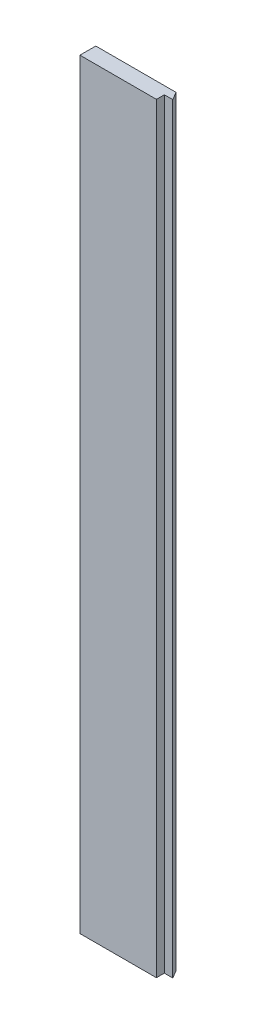
ISO-10303-21;
HEADER;
FILE_DESCRIPTION(('STEP AP214'),'2;1');
FILE_NAME('part.step','',(''),(''),'','','');
FILE_SCHEMA(('AUTOMOTIVE_DESIGN { 1 0 10303 214 1 1 1 1 }'));
ENDSEC;
DATA;
#1=APPLICATION_CONTEXT('core data for automotive mechanical design processes');
#2=APPLICATION_PROTOCOL_DEFINITION('international standard','automotive_design',2000,#1);
#3=PRODUCT_CONTEXT('',#1,'mechanical');
#4=PRODUCT('Part','Part','',(#3));
#5=PRODUCT_RELATED_PRODUCT_CATEGORY('part','',(#4));
#6=PRODUCT_DEFINITION_FORMATION('','',#4);
#7=PRODUCT_DEFINITION_CONTEXT('part definition',#1,'design');
#8=PRODUCT_DEFINITION('design','',#6,#7);
#9=PRODUCT_DEFINITION_SHAPE('','',#8);
#10=(LENGTH_UNIT() NAMED_UNIT(*) SI_UNIT(.MILLI.,.METRE.));
#11=(NAMED_UNIT(*) PLANE_ANGLE_UNIT() SI_UNIT($,.RADIAN.));
#12=(NAMED_UNIT(*) SI_UNIT($,.STERADIAN.) SOLID_ANGLE_UNIT());
#13=UNCERTAINTY_MEASURE_WITH_UNIT(LENGTH_MEASURE(1.E-05),#10,'distance_accuracy_value','');
#14=(GEOMETRIC_REPRESENTATION_CONTEXT(3) GLOBAL_UNCERTAINTY_ASSIGNED_CONTEXT((#13)) GLOBAL_UNIT_ASSIGNED_CONTEXT((#10,
#11,#12)) REPRESENTATION_CONTEXT('',''));
#15=CARTESIAN_POINT('',(0.,0.,0.));
#16=DIRECTION('',(0.,0.,1.));
#17=DIRECTION('',(1.,0.,0.));
#18=AXIS2_PLACEMENT_3D('',#15,#16,#17);
#19=CARTESIAN_POINT('',(50.5,1000.,0.));
#20=DIRECTION('',(1.,0.,0.));
#21=DIRECTION('',(0.,0.,-1.));
#22=AXIS2_PLACEMENT_3D('',#19,#20,#21);
#23=PLANE('',#22);
#24=DIRECTION('',(0.,-1.,0.));
#25=VECTOR('',#24,1.);
#26=CARTESIAN_POINT('',(50.5,1000.,0.));
#27=LINE('',#26,#25);
#28=CARTESIAN_POINT('',(50.5,863.148307071275,0.));
#29=VERTEX_POINT('',#28);
#30=CARTESIAN_POINT('',(50.5,0.,0.));
#31=VERTEX_POINT('',#30);
#32=EDGE_CURVE('E11',#29,#31,#27,.T.);
#33=ORIENTED_EDGE('',*,*,#32,.F.);
#34=DIRECTION('',(0.,0.,-1.));
#35=VECTOR('',#34,1.);
#36=CARTESIAN_POINT('',(50.5,863.148307071275,9.001));
#37=LINE('',#36,#35);
#38=CARTESIAN_POINT('',(50.5,863.148307071275,9.));
#39=VERTEX_POINT('',#38);
#40=EDGE_CURVE('E113',#39,#29,#37,.T.);
#41=ORIENTED_EDGE('',*,*,#40,.F.);
#42=DIRECTION('',(0.,-1.,0.));
#43=VECTOR('',#42,1.);
#44=CARTESIAN_POINT('',(50.5,1000.,9.));
#45=LINE('',#44,#43);
#46=CARTESIAN_POINT('',(50.5,0.,9.));
#47=VERTEX_POINT('',#46);
#48=EDGE_CURVE('E49',#39,#47,#45,.T.);
#49=ORIENTED_EDGE('',*,*,#48,.T.);
#50=DIRECTION('',(0.,0.,1.));
#51=VECTOR('',#50,1.);
#52=CARTESIAN_POINT('',(50.5,0.,0.));
#53=LINE('',#52,#51);
#54=EDGE_CURVE('E115',#31,#47,#53,.T.);
#55=ORIENTED_EDGE('',*,*,#54,.F.);
#56=EDGE_LOOP('',(#33,#41,#49,#55));
#57=FACE_BOUND('',#56,.T.);
#58=ADVANCED_FACE('F35',(#57),#23,.T.);
#59=CARTESIAN_POINT('',(0.,1000.,0.));
#60=DIRECTION('',(0.,0.,1.));
#61=DIRECTION('',(1.,0.,0.));
#62=AXIS2_PLACEMENT_3D('',#59,#60,#61);
#63=PLANE('',#62);
#64=DIRECTION('',(0.,-1.,0.));
#65=VECTOR('',#64,1.);
#66=CARTESIAN_POINT('',(60.,1000.,0.));
#67=LINE('',#66,#65);
#68=CARTESIAN_POINT('',(60.,863.148307071275,0.));
#69=VERTEX_POINT('',#68);
#70=CARTESIAN_POINT('',(60.,0.,0.));
#71=VERTEX_POINT('',#70);
#72=EDGE_CURVE('E42',#69,#71,#67,.T.);
#73=ORIENTED_EDGE('',*,*,#72,.F.);
#74=DIRECTION('',(1.,0.,0.));
#75=VECTOR('',#74,1.);
#76=CARTESIAN_POINT('',(0.,863.148307071275,0.));
#77=LINE('',#76,#75);
#78=EDGE_CURVE('E140',#29,#69,#77,.T.);
#79=ORIENTED_EDGE('',*,*,#78,.F.);
#80=ORIENTED_EDGE('',*,*,#32,.T.);
#81=DIRECTION('',(-1.,0.,0.));
#82=VECTOR('',#81,1.);
#83=CARTESIAN_POINT('',(0.,0.,0.));
#84=LINE('',#83,#82);
#85=EDGE_CURVE('E118',#71,#31,#84,.T.);
#86=ORIENTED_EDGE('',*,*,#85,.F.);
#87=EDGE_LOOP('',(#73,#79,#80,#86));
#88=FACE_BOUND('',#87,.T.);
#89=ADVANCED_FACE('F138',(#88),#63,.T.);
#90=CARTESIAN_POINT('',(45.0000000000002,1000.,-25.980762113533));
#91=DIRECTION('',(-0.866025403784441,0.,0.499999999999996));
#92=DIRECTION('',(0.499999999999997,0.,0.866025403784441));
#93=AXIS2_PLACEMENT_3D('',#90,#91,#92);
#94=PLANE('',#93);
#95=DIRECTION('',(0.499999999999997,0.,0.866025403784441));
#96=VECTOR('',#95,1.);
#97=CARTESIAN_POINT('',(48.8975473297321,863.148307071275,-19.230012113533));
#98=LINE('',#97,#96);
#99=CARTESIAN_POINT('',(54.8038475772934,863.148307071275,-9.));
#100=VERTEX_POINT('',#99);
#101=EDGE_CURVE('E99',#100,#69,#98,.T.);
#102=ORIENTED_EDGE('',*,*,#101,.T.);
#103=ORIENTED_EDGE('',*,*,#72,.T.);
#104=DIRECTION('',(-0.499999999999997,0.,-0.866025403784441));
#105=VECTOR('',#104,1.);
#106=CARTESIAN_POINT('',(45.0000000000002,0.,-25.980762113533));
#107=LINE('',#106,#105);
#108=CARTESIAN_POINT('',(54.8038475772934,0.,-9.));
#109=VERTEX_POINT('',#108);
#110=EDGE_CURVE('E121',#71,#109,#107,.T.);
#111=ORIENTED_EDGE('',*,*,#110,.T.);
#112=DIRECTION('',(0.,-1.,0.));
#113=VECTOR('',#112,1.);
#114=CARTESIAN_POINT('',(54.8038475772934,1000.,-9.));
#115=LINE('',#114,#113);
#116=EDGE_CURVE('E128',#100,#109,#115,.T.);
#117=ORIENTED_EDGE('',*,*,#116,.F.);
#118=EDGE_LOOP('',(#102,#103,#111,#117));
#119=FACE_BOUND('',#118,.T.);
#120=ADVANCED_FACE('F132',(#119),#94,.F.);
#121=CARTESIAN_POINT('',(0.,1000.,-9.));
#122=DIRECTION('',(0.,0.,-1.));
#123=DIRECTION('',(-1.,0.,0.));
#124=AXIS2_PLACEMENT_3D('',#121,#122,#123);
#125=PLANE('',#124);
#126=DIRECTION('',(0.,1.,0.));
#127=VECTOR('',#126,1.);
#128=CARTESIAN_POINT('',(-36.3038475772933,0.,-9.));
#129=LINE('',#128,#127);
#130=CARTESIAN_POINT('',(-36.3038475772933,0.,-9.));
#131=VERTEX_POINT('',#130);
#132=CARTESIAN_POINT('',(-36.3038475772933,863.148307071275,-9.));
#133=VERTEX_POINT('',#132);
#134=EDGE_CURVE('E57',#131,#133,#129,.T.);
#135=ORIENTED_EDGE('',*,*,#134,.T.);
#136=DIRECTION('',(1.,0.,0.));
#137=VECTOR('',#136,1.);
#138=CARTESIAN_POINT('',(0.,863.148307071275,-9.));
#139=LINE('',#138,#137);
#140=EDGE_CURVE('E96',#133,#100,#139,.T.);
#141=ORIENTED_EDGE('',*,*,#140,.T.);
#142=ORIENTED_EDGE('',*,*,#116,.T.);
#143=DIRECTION('',(1.,0.,0.));
#144=VECTOR('',#143,1.);
#145=CARTESIAN_POINT('',(0.,0.,-9.));
#146=LINE('',#145,#144);
#147=EDGE_CURVE('E106',#131,#109,#146,.T.);
#148=ORIENTED_EDGE('',*,*,#147,.F.);
#149=EDGE_LOOP('',(#135,#141,#142,#148));
#150=FACE_BOUND('',#149,.T.);
#151=ADVANCED_FACE('F104',(#150),#125,.T.);
#152=CARTESIAN_POINT('',(0.,1000.,9.));
#153=DIRECTION('',(0.,0.,-1.));
#154=DIRECTION('',(-1.,0.,0.));
#155=AXIS2_PLACEMENT_3D('',#152,#153,#154);
#156=PLANE('',#155);
#157=DIRECTION('',(0.,-1.,0.));
#158=VECTOR('',#157,1.);
#159=CARTESIAN_POINT('',(-36.3038475772933,0.,9.));
#160=LINE('',#159,#158);
#161=CARTESIAN_POINT('',(-36.3038475772933,863.148307071275,9.));
#162=VERTEX_POINT('',#161);
#163=CARTESIAN_POINT('',(-36.3038475772933,0.,9.));
#164=VERTEX_POINT('',#163);
#165=EDGE_CURVE('E90',#162,#164,#160,.T.);
#166=ORIENTED_EDGE('',*,*,#165,.T.);
#167=DIRECTION('',(1.,0.,0.));
#168=VECTOR('',#167,1.);
#169=CARTESIAN_POINT('',(0.,0.,9.));
#170=LINE('',#169,#168);
#171=EDGE_CURVE('E125',#164,#47,#170,.T.);
#172=ORIENTED_EDGE('',*,*,#171,.T.);
#173=ORIENTED_EDGE('',*,*,#48,.F.);
#174=DIRECTION('',(-1.,0.,0.));
#175=VECTOR('',#174,1.);
#176=CARTESIAN_POINT('',(0.,863.148307071275,9.));
#177=LINE('',#176,#175);
#178=EDGE_CURVE('E110',#39,#162,#177,.T.);
#179=ORIENTED_EDGE('',*,*,#178,.T.);
#180=EDGE_LOOP('',(#166,#172,#173,#179));
#181=FACE_BOUND('',#180,.T.);
#182=ADVANCED_FACE('F143',(#181),#156,.F.);
#183=CARTESIAN_POINT('',(0.,0.,0.));
#184=DIRECTION('',(0.,1.,0.));
#185=DIRECTION('',(0.,0.,1.));
#186=AXIS2_PLACEMENT_3D('',#183,#184,#185);
#187=PLANE('',#186);
#188=DIRECTION('',(0.,0.,-1.));
#189=VECTOR('',#188,1.);
#190=CARTESIAN_POINT('',(-36.3038475772933,0.,9.001));
#191=LINE('',#190,#189);
#192=EDGE_CURVE('E93',#164,#131,#191,.T.);
#193=ORIENTED_EDGE('',*,*,#192,.T.);
#194=ORIENTED_EDGE('',*,*,#147,.T.);
#195=ORIENTED_EDGE('',*,*,#110,.F.);
#196=ORIENTED_EDGE('',*,*,#85,.T.);
#197=ORIENTED_EDGE('',*,*,#54,.T.);
#198=ORIENTED_EDGE('',*,*,#171,.F.);
#199=EDGE_LOOP('',(#193,#194,#195,#196,#197,#198));
#200=FACE_BOUND('',#199,.T.);
#201=ADVANCED_FACE('F137',(#200),#187,.F.);
#202=CARTESIAN_POINT('',(-36.3038475772933,0.,9.001));
#203=DIRECTION('',(-1.,0.,0.));
#204=DIRECTION('',(0.,0.,1.));
#205=AXIS2_PLACEMENT_3D('',#202,#203,#204);
#206=PLANE('',#205);
#207=DIRECTION('',(0.,0.,-1.));
#208=VECTOR('',#207,1.);
#209=CARTESIAN_POINT('',(-36.3038475772933,863.148307071275,9.001));
#210=LINE('',#209,#208);
#211=EDGE_CURVE('E86',#162,#133,#210,.T.);
#212=ORIENTED_EDGE('',*,*,#211,.T.);
#213=ORIENTED_EDGE('',*,*,#134,.F.);
#214=ORIENTED_EDGE('',*,*,#192,.F.);
#215=ORIENTED_EDGE('',*,*,#165,.F.);
#216=EDGE_LOOP('',(#212,#213,#214,#215));
#217=FACE_BOUND('',#216,.T.);
#218=ADVANCED_FACE('F88',(#217),#206,.T.);
#219=CARTESIAN_POINT('',(0.,863.148307071275,9.001));
#220=DIRECTION('',(0.,1.,0.));
#221=DIRECTION('',(0.,0.,1.));
#222=AXIS2_PLACEMENT_3D('',#219,#220,#221);
#223=PLANE('',#222);
#224=ORIENTED_EDGE('',*,*,#140,.F.);
#225=ORIENTED_EDGE('',*,*,#211,.F.);
#226=ORIENTED_EDGE('',*,*,#178,.F.);
#227=ORIENTED_EDGE('',*,*,#40,.T.);
#228=ORIENTED_EDGE('',*,*,#78,.T.);
#229=ORIENTED_EDGE('',*,*,#101,.F.);
#230=EDGE_LOOP('',(#224,#225,#226,#227,#228,#229));
#231=FACE_BOUND('',#230,.T.);
#232=ADVANCED_FACE('F97',(#231),#223,.T.);
#233=CLOSED_SHELL('',(#58,#89,#120,#151,#182,#201,#218,#232));
#234=MANIFOLD_SOLID_BREP('B2',#233);
#235=ADVANCED_BREP_SHAPE_REPRESENTATION('',(#18,#234),#14);
#236=SHAPE_DEFINITION_REPRESENTATION(#9,#235);
ENDSEC;
END-ISO-10303-21;
